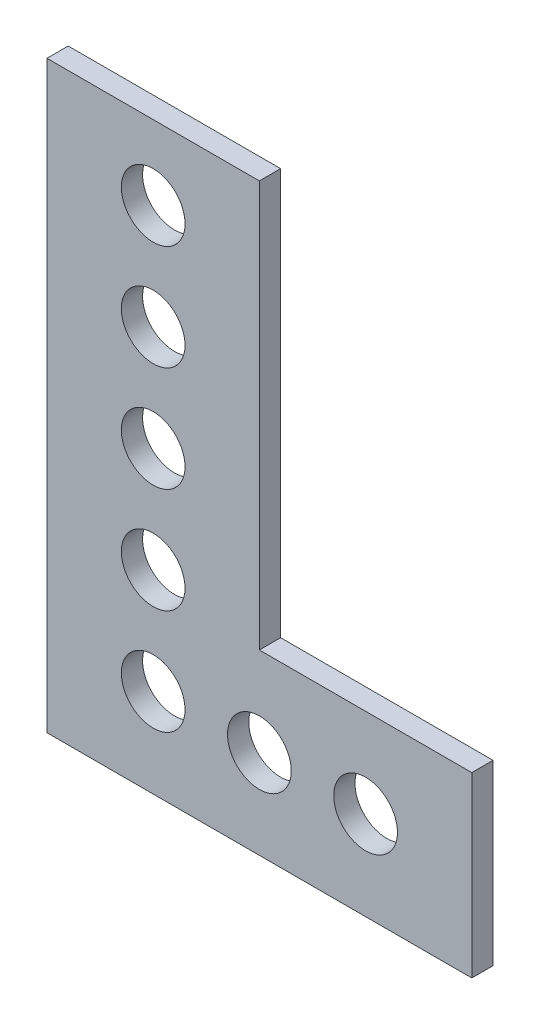
ISO-10303-21;
HEADER;
FILE_DESCRIPTION(('STEP AP214'),'2;1');
FILE_NAME('part.step','',(''),(''),'','','');
FILE_SCHEMA(('AUTOMOTIVE_DESIGN { 1 0 10303 214 1 1 1 1 }'));
ENDSEC;
DATA;
#1=APPLICATION_CONTEXT('core data for automotive mechanical design processes');
#2=APPLICATION_PROTOCOL_DEFINITION('international standard','automotive_design',2000,#1);
#3=PRODUCT_CONTEXT('',#1,'mechanical');
#4=PRODUCT('Part','Part','',(#3));
#5=PRODUCT_RELATED_PRODUCT_CATEGORY('part','',(#4));
#6=PRODUCT_DEFINITION_FORMATION('','',#4);
#7=PRODUCT_DEFINITION_CONTEXT('part definition',#1,'design');
#8=PRODUCT_DEFINITION('design','',#6,#7);
#9=PRODUCT_DEFINITION_SHAPE('','',#8);
#10=(LENGTH_UNIT() NAMED_UNIT(*) SI_UNIT(.MILLI.,.METRE.));
#11=(NAMED_UNIT(*) PLANE_ANGLE_UNIT() SI_UNIT($,.RADIAN.));
#12=(NAMED_UNIT(*) SI_UNIT($,.STERADIAN.) SOLID_ANGLE_UNIT());
#13=UNCERTAINTY_MEASURE_WITH_UNIT(LENGTH_MEASURE(1.E-05),#10,'distance_accuracy_value','');
#14=(GEOMETRIC_REPRESENTATION_CONTEXT(3) GLOBAL_UNCERTAINTY_ASSIGNED_CONTEXT((#13)) GLOBAL_UNIT_ASSIGNED_CONTEXT((#10,
#11,#12)) REPRESENTATION_CONTEXT('',''));
#15=CARTESIAN_POINT('',(0.,0.,0.));
#16=DIRECTION('',(0.,0.,1.));
#17=DIRECTION('',(1.,0.,0.));
#18=AXIS2_PLACEMENT_3D('',#15,#16,#17);
#19=CARTESIAN_POINT('',(0.,0.,2.));
#20=DIRECTION('',(0.,0.,1.));
#21=DIRECTION('',(1.,0.,0.));
#22=AXIS2_PLACEMENT_3D('',#19,#20,#21);
#23=PLANE('',#22);
#24=CARTESIAN_POINT('',(-10.0000000000001,8.3749999999999,2.));
#25=DIRECTION('',(0.,0.,1.));
#26=DIRECTION('',(1.,0.,0.));
#27=AXIS2_PLACEMENT_3D('',#24,#25,#26);
#28=CIRCLE('',#27,3.00000000000056);
#29=CARTESIAN_POINT('',(-6.99999999999954,8.3749999999999,2.));
#30=VERTEX_POINT('',#29);
#31=EDGE_CURVE('E201',#30,#30,#28,.T.);
#32=ORIENTED_EDGE('',*,*,#31,.F.);
#33=EDGE_LOOP('',(#32));
#34=FACE_BOUND('',#33,.T.);
#35=CARTESIAN_POINT('',(-9.99999999999997,28.1875,2.));
#36=DIRECTION('',(0.,0.,1.));
#37=DIRECTION('',(1.,0.,0.));
#38=AXIS2_PLACEMENT_3D('',#35,#36,#37);
#39=CIRCLE('',#38,3.);
#40=CARTESIAN_POINT('',(-6.99999999999997,28.1875,2.));
#41=VERTEX_POINT('',#40);
#42=EDGE_CURVE('E213',#41,#41,#39,.T.);
#43=ORIENTED_EDGE('',*,*,#42,.F.);
#44=EDGE_LOOP('',(#43));
#45=FACE_BOUND('',#44,.T.);
#46=CARTESIAN_POINT('',(9.99999999999982,8.375,2.));
#47=DIRECTION('',(0.,0.,1.));
#48=DIRECTION('',(1.,0.,0.));
#49=AXIS2_PLACEMENT_3D('',#46,#47,#48);
#50=CIRCLE('',#49,3.);
#51=CARTESIAN_POINT('',(12.9999999999998,8.375,2.));
#52=VERTEX_POINT('',#51);
#53=EDGE_CURVE('E225',#52,#52,#50,.T.);
#54=ORIENTED_EDGE('',*,*,#53,.F.);
#55=EDGE_LOOP('',(#54));
#56=FACE_BOUND('',#55,.T.);
#57=DIRECTION('',(-1.,0.,0.));
#58=VECTOR('',#57,1.);
#59=CARTESIAN_POINT('',(-1.75207071073657E-13,55.,2.));
#60=LINE('',#59,#58);
#61=CARTESIAN_POINT('',(-1.75207071073657E-13,55.,2.));
#62=VERTEX_POINT('',#61);
#63=CARTESIAN_POINT('',(-20.0000000000002,55.,2.));
#64=VERTEX_POINT('',#63);
#65=EDGE_CURVE('E129',#62,#64,#60,.T.);
#66=ORIENTED_EDGE('',*,*,#65,.T.);
#67=DIRECTION('',(0.,-1.,0.));
#68=VECTOR('',#67,1.);
#69=CARTESIAN_POINT('',(-20.0000000000002,55.,2.));
#70=LINE('',#69,#68);
#71=CARTESIAN_POINT('',(-20.,-2.09488880330588E-13,2.));
#72=VERTEX_POINT('',#71);
#73=EDGE_CURVE('E87',#64,#72,#70,.T.);
#74=ORIENTED_EDGE('',*,*,#73,.T.);
#75=DIRECTION('',(1.,0.,0.));
#76=VECTOR('',#75,1.);
#77=CARTESIAN_POINT('',(-20.,-2.09488880330588E-13,2.));
#78=LINE('',#77,#76);
#79=CARTESIAN_POINT('',(20.,2.09488880330588E-13,2.));
#80=VERTEX_POINT('',#79);
#81=EDGE_CURVE('E100',#72,#80,#78,.T.);
#82=ORIENTED_EDGE('',*,*,#81,.T.);
#83=DIRECTION('',(0.,1.,0.));
#84=VECTOR('',#83,1.);
#85=CARTESIAN_POINT('',(20.,2.09488880330588E-13,2.));
#86=LINE('',#85,#84);
#87=CARTESIAN_POINT('',(19.9999999999998,16.7500000000002,2.));
#88=VERTEX_POINT('',#87);
#89=EDGE_CURVE('E94',#80,#88,#86,.T.);
#90=ORIENTED_EDGE('',*,*,#89,.T.);
#91=DIRECTION('',(-1.,0.,0.));
#92=VECTOR('',#91,1.);
#93=CARTESIAN_POINT('',(19.9999999999998,16.7500000000002,2.));
#94=LINE('',#93,#92);
#95=CARTESIAN_POINT('',(-1.75446937276867E-13,16.75,2.));
#96=VERTEX_POINT('',#95);
#97=EDGE_CURVE('E98',#88,#96,#94,.T.);
#98=ORIENTED_EDGE('',*,*,#97,.T.);
#99=DIRECTION('',(0.,1.,0.));
#100=VECTOR('',#99,1.);
#101=CARTESIAN_POINT('',(-1.75446937276867E-13,16.75,2.));
#102=LINE('',#101,#100);
#103=EDGE_CURVE('E50',#96,#62,#102,.T.);
#104=ORIENTED_EDGE('',*,*,#103,.T.);
#105=EDGE_LOOP('',(#66,#74,#82,#90,#98,#104));
#106=FACE_BOUND('',#105,.T.);
#107=CARTESIAN_POINT('',(-10.0000000000002,48.,2.));
#108=DIRECTION('',(0.,0.,1.));
#109=DIRECTION('',(1.,0.,0.));
#110=AXIS2_PLACEMENT_3D('',#107,#108,#109);
#111=CIRCLE('',#110,3.00000000000001);
#112=CARTESIAN_POINT('',(-7.00000000000017,48.,2.));
#113=VERTEX_POINT('',#112);
#114=EDGE_CURVE('E122',#113,#113,#111,.T.);
#115=ORIENTED_EDGE('',*,*,#114,.F.);
#116=EDGE_LOOP('',(#115));
#117=FACE_BOUND('',#116,.T.);
#118=CARTESIAN_POINT('',(-10.0000000000001,38.09375,2.));
#119=DIRECTION('',(0.,0.,1.));
#120=DIRECTION('',(1.,0.,0.));
#121=AXIS2_PLACEMENT_3D('',#118,#119,#120);
#122=CIRCLE('',#121,3.);
#123=CARTESIAN_POINT('',(-7.00000000000007,38.09375,2.));
#124=VERTEX_POINT('',#123);
#125=EDGE_CURVE('E219',#124,#124,#122,.T.);
#126=ORIENTED_EDGE('',*,*,#125,.F.);
#127=EDGE_LOOP('',(#126));
#128=FACE_BOUND('',#127,.T.);
#129=CARTESIAN_POINT('',(-9.99999999999987,18.28125,2.));
#130=DIRECTION('',(0.,0.,1.));
#131=DIRECTION('',(1.,0.,0.));
#132=AXIS2_PLACEMENT_3D('',#129,#130,#131);
#133=CIRCLE('',#132,3.);
#134=CARTESIAN_POINT('',(-6.99999999999987,18.28125,2.));
#135=VERTEX_POINT('',#134);
#136=EDGE_CURVE('E207',#135,#135,#133,.T.);
#137=ORIENTED_EDGE('',*,*,#136,.F.);
#138=EDGE_LOOP('',(#137));
#139=FACE_BOUND('',#138,.T.);
#140=CARTESIAN_POINT('',(0.,8.3749999999999,2.));
#141=DIRECTION('',(0.,0.,1.));
#142=DIRECTION('',(1.,0.,0.));
#143=AXIS2_PLACEMENT_3D('',#140,#141,#142);
#144=CIRCLE('',#143,3.);
#145=CARTESIAN_POINT('',(2.99999999999996,8.3749999999999,2.));
#146=VERTEX_POINT('',#145);
#147=EDGE_CURVE('E192',#146,#146,#144,.T.);
#148=ORIENTED_EDGE('',*,*,#147,.F.);
#149=EDGE_LOOP('',(#148));
#150=FACE_BOUND('',#149,.T.);
#151=ADVANCED_FACE('F33',(#34,#45,#56,#106,#117,#128,#139,#150),#23,.T.);
#152=CARTESIAN_POINT('',(0.,0.,0.));
#153=DIRECTION('',(0.,0.,1.));
#154=DIRECTION('',(1.,0.,0.));
#155=AXIS2_PLACEMENT_3D('',#152,#153,#154);
#156=PLANE('',#155);
#157=DIRECTION('',(-1.,0.,0.));
#158=VECTOR('',#157,1.);
#159=CARTESIAN_POINT('',(-1.75207071073657E-13,55.,0.));
#160=LINE('',#159,#158);
#161=CARTESIAN_POINT('',(-1.75207071073657E-13,55.,0.));
#162=VERTEX_POINT('',#161);
#163=CARTESIAN_POINT('',(-20.0000000000002,55.,0.));
#164=VERTEX_POINT('',#163);
#165=EDGE_CURVE('E118',#162,#164,#160,.T.);
#166=ORIENTED_EDGE('',*,*,#165,.F.);
#167=DIRECTION('',(0.,1.,0.));
#168=VECTOR('',#167,1.);
#169=CARTESIAN_POINT('',(-1.75446937276867E-13,16.75,0.));
#170=LINE('',#169,#168);
#171=CARTESIAN_POINT('',(-1.75446937276867E-13,16.75,0.));
#172=VERTEX_POINT('',#171);
#173=EDGE_CURVE('E79',#172,#162,#170,.T.);
#174=ORIENTED_EDGE('',*,*,#173,.F.);
#175=DIRECTION('',(-1.,0.,0.));
#176=VECTOR('',#175,1.);
#177=CARTESIAN_POINT('',(19.9999999999998,16.7500000000002,0.));
#178=LINE('',#177,#176);
#179=CARTESIAN_POINT('',(19.9999999999998,16.7500000000002,0.));
#180=VERTEX_POINT('',#179);
#181=EDGE_CURVE('E73',#180,#172,#178,.T.);
#182=ORIENTED_EDGE('',*,*,#181,.F.);
#183=DIRECTION('',(0.,1.,0.));
#184=VECTOR('',#183,1.);
#185=CARTESIAN_POINT('',(20.,2.09488880330588E-13,0.));
#186=LINE('',#185,#184);
#187=CARTESIAN_POINT('',(20.,2.09488880330588E-13,0.));
#188=VERTEX_POINT('',#187);
#189=EDGE_CURVE('E108',#188,#180,#186,.T.);
#190=ORIENTED_EDGE('',*,*,#189,.F.);
#191=DIRECTION('',(1.,0.,0.));
#192=VECTOR('',#191,1.);
#193=CARTESIAN_POINT('',(-20.,-2.09488880330588E-13,0.));
#194=LINE('',#193,#192);
#195=CARTESIAN_POINT('',(-20.,-2.09488880330588E-13,0.));
#196=VERTEX_POINT('',#195);
#197=EDGE_CURVE('E124',#196,#188,#194,.T.);
#198=ORIENTED_EDGE('',*,*,#197,.F.);
#199=DIRECTION('',(0.,-1.,0.));
#200=VECTOR('',#199,1.);
#201=CARTESIAN_POINT('',(-20.0000000000002,55.,0.));
#202=LINE('',#201,#200);
#203=EDGE_CURVE('E121',#164,#196,#202,.T.);
#204=ORIENTED_EDGE('',*,*,#203,.F.);
#205=EDGE_LOOP('',(#166,#174,#182,#190,#198,#204));
#206=FACE_BOUND('',#205,.T.);
#207=CARTESIAN_POINT('',(-10.0000000000002,48.,0.));
#208=DIRECTION('',(0.,0.,1.));
#209=DIRECTION('',(1.,0.,0.));
#210=AXIS2_PLACEMENT_3D('',#207,#208,#209);
#211=CIRCLE('',#210,3.00000000000001);
#212=CARTESIAN_POINT('',(-7.00000000000017,48.,0.));
#213=VERTEX_POINT('',#212);
#214=EDGE_CURVE('E228',#213,#213,#211,.T.);
#215=ORIENTED_EDGE('',*,*,#214,.T.);
#216=EDGE_LOOP('',(#215));
#217=FACE_BOUND('',#216,.T.);
#218=CARTESIAN_POINT('',(9.99999999999982,8.375,0.));
#219=DIRECTION('',(0.,0.,1.));
#220=DIRECTION('',(1.,0.,0.));
#221=AXIS2_PLACEMENT_3D('',#218,#219,#220);
#222=CIRCLE('',#221,3.);
#223=CARTESIAN_POINT('',(12.9999999999998,8.375,0.));
#224=VERTEX_POINT('',#223);
#225=EDGE_CURVE('E222',#224,#224,#222,.T.);
#226=ORIENTED_EDGE('',*,*,#225,.T.);
#227=EDGE_LOOP('',(#226));
#228=FACE_BOUND('',#227,.T.);
#229=CARTESIAN_POINT('',(-10.0000000000001,38.09375,0.));
#230=DIRECTION('',(0.,0.,1.));
#231=DIRECTION('',(1.,0.,0.));
#232=AXIS2_PLACEMENT_3D('',#229,#230,#231);
#233=CIRCLE('',#232,3.);
#234=CARTESIAN_POINT('',(-7.00000000000007,38.09375,0.));
#235=VERTEX_POINT('',#234);
#236=EDGE_CURVE('E216',#235,#235,#233,.T.);
#237=ORIENTED_EDGE('',*,*,#236,.T.);
#238=EDGE_LOOP('',(#237));
#239=FACE_BOUND('',#238,.T.);
#240=CARTESIAN_POINT('',(-9.99999999999997,28.1875,0.));
#241=DIRECTION('',(0.,0.,1.));
#242=DIRECTION('',(1.,0.,0.));
#243=AXIS2_PLACEMENT_3D('',#240,#241,#242);
#244=CIRCLE('',#243,3.);
#245=CARTESIAN_POINT('',(-6.99999999999997,28.1875,0.));
#246=VERTEX_POINT('',#245);
#247=EDGE_CURVE('E210',#246,#246,#244,.T.);
#248=ORIENTED_EDGE('',*,*,#247,.T.);
#249=EDGE_LOOP('',(#248));
#250=FACE_BOUND('',#249,.T.);
#251=CARTESIAN_POINT('',(-9.99999999999987,18.28125,0.));
#252=DIRECTION('',(0.,0.,1.));
#253=DIRECTION('',(1.,0.,0.));
#254=AXIS2_PLACEMENT_3D('',#251,#252,#253);
#255=CIRCLE('',#254,3.);
#256=CARTESIAN_POINT('',(-6.99999999999987,18.28125,0.));
#257=VERTEX_POINT('',#256);
#258=EDGE_CURVE('E204',#257,#257,#255,.T.);
#259=ORIENTED_EDGE('',*,*,#258,.T.);
#260=EDGE_LOOP('',(#259));
#261=FACE_BOUND('',#260,.T.);
#262=CARTESIAN_POINT('',(-10.0000000000001,8.3749999999999,0.));
#263=DIRECTION('',(0.,0.,1.));
#264=DIRECTION('',(1.,0.,0.));
#265=AXIS2_PLACEMENT_3D('',#262,#263,#264);
#266=CIRCLE('',#265,3.00000000000056);
#267=CARTESIAN_POINT('',(-6.99999999999954,8.3749999999999,0.));
#268=VERTEX_POINT('',#267);
#269=EDGE_CURVE('E198',#268,#268,#266,.T.);
#270=ORIENTED_EDGE('',*,*,#269,.T.);
#271=EDGE_LOOP('',(#270));
#272=FACE_BOUND('',#271,.T.);
#273=CARTESIAN_POINT('',(0.,8.3749999999999,0.));
#274=DIRECTION('',(0.,0.,1.));
#275=DIRECTION('',(1.,0.,0.));
#276=AXIS2_PLACEMENT_3D('',#273,#274,#275);
#277=CIRCLE('',#276,3.);
#278=CARTESIAN_POINT('',(2.99999999999996,8.3749999999999,0.));
#279=VERTEX_POINT('',#278);
#280=EDGE_CURVE('E195',#279,#279,#277,.T.);
#281=ORIENTED_EDGE('',*,*,#280,.T.);
#282=EDGE_LOOP('',(#281));
#283=FACE_BOUND('',#282,.T.);
#284=ADVANCED_FACE('F138',(#206,#217,#228,#239,#250,#261,#272,#283),#156,.F.);
#285=CARTESIAN_POINT('',(-1.75207071073657E-13,55.,2.));
#286=DIRECTION('',(0.,-1.,0.));
#287=DIRECTION('',(0.,0.,-1.));
#288=AXIS2_PLACEMENT_3D('',#285,#286,#287);
#289=PLANE('',#288);
#290=ORIENTED_EDGE('',*,*,#165,.T.);
#291=DIRECTION('',(0.,0.,-1.));
#292=VECTOR('',#291,1.);
#293=CARTESIAN_POINT('',(-20.0000000000002,55.,2.));
#294=LINE('',#293,#292);
#295=EDGE_CURVE('E11',#64,#164,#294,.T.);
#296=ORIENTED_EDGE('',*,*,#295,.F.);
#297=ORIENTED_EDGE('',*,*,#65,.F.);
#298=DIRECTION('',(0.,0.,-1.));
#299=VECTOR('',#298,1.);
#300=CARTESIAN_POINT('',(-1.75207071073657E-13,55.,2.));
#301=LINE('',#300,#299);
#302=EDGE_CURVE('E114',#62,#162,#301,.T.);
#303=ORIENTED_EDGE('',*,*,#302,.T.);
#304=EDGE_LOOP('',(#290,#296,#297,#303));
#305=FACE_BOUND('',#304,.T.);
#306=ADVANCED_FACE('F35',(#305),#289,.F.);
#307=CARTESIAN_POINT('',(-20.0000000000002,55.,2.));
#308=DIRECTION('',(1.,0.,0.));
#309=DIRECTION('',(0.,1.,0.));
#310=AXIS2_PLACEMENT_3D('',#307,#308,#309);
#311=PLANE('',#310);
#312=ORIENTED_EDGE('',*,*,#203,.T.);
#313=DIRECTION('',(0.,0.,-1.));
#314=VECTOR('',#313,1.);
#315=CARTESIAN_POINT('',(-20.,-2.09488880330588E-13,2.));
#316=LINE('',#315,#314);
#317=EDGE_CURVE('E42',#72,#196,#316,.T.);
#318=ORIENTED_EDGE('',*,*,#317,.F.);
#319=ORIENTED_EDGE('',*,*,#73,.F.);
#320=ORIENTED_EDGE('',*,*,#295,.T.);
#321=EDGE_LOOP('',(#312,#318,#319,#320));
#322=FACE_BOUND('',#321,.T.);
#323=ADVANCED_FACE('F313',(#322),#311,.F.);
#324=CARTESIAN_POINT('',(-20.,-2.09488880330588E-13,2.));
#325=DIRECTION('',(0.,1.,0.));
#326=DIRECTION('',(-1.,0.,0.));
#327=AXIS2_PLACEMENT_3D('',#324,#325,#326);
#328=PLANE('',#327);
#329=ORIENTED_EDGE('',*,*,#197,.T.);
#330=DIRECTION('',(0.,0.,-1.));
#331=VECTOR('',#330,1.);
#332=CARTESIAN_POINT('',(20.,2.09488880330588E-13,2.));
#333=LINE('',#332,#331);
#334=EDGE_CURVE('E109',#80,#188,#333,.T.);
#335=ORIENTED_EDGE('',*,*,#334,.F.);
#336=ORIENTED_EDGE('',*,*,#81,.F.);
#337=ORIENTED_EDGE('',*,*,#317,.T.);
#338=EDGE_LOOP('',(#329,#335,#336,#337));
#339=FACE_BOUND('',#338,.T.);
#340=ADVANCED_FACE('F135',(#339),#328,.F.);
#341=CARTESIAN_POINT('',(20.,2.09488880330588E-13,2.));
#342=DIRECTION('',(-1.,0.,0.));
#343=DIRECTION('',(0.,-1.,0.));
#344=AXIS2_PLACEMENT_3D('',#341,#342,#343);
#345=PLANE('',#344);
#346=ORIENTED_EDGE('',*,*,#189,.T.);
#347=DIRECTION('',(0.,0.,-1.));
#348=VECTOR('',#347,1.);
#349=CARTESIAN_POINT('',(19.9999999999998,16.7500000000002,2.));
#350=LINE('',#349,#348);
#351=EDGE_CURVE('E105',#88,#180,#350,.T.);
#352=ORIENTED_EDGE('',*,*,#351,.F.);
#353=ORIENTED_EDGE('',*,*,#89,.F.);
#354=ORIENTED_EDGE('',*,*,#334,.T.);
#355=EDGE_LOOP('',(#346,#352,#353,#354));
#356=FACE_BOUND('',#355,.T.);
#357=ADVANCED_FACE('F106',(#356),#345,.F.);
#358=CARTESIAN_POINT('',(19.9999999999998,16.7500000000002,2.));
#359=DIRECTION('',(0.,-1.,0.));
#360=DIRECTION('',(1.,0.,0.));
#361=AXIS2_PLACEMENT_3D('',#358,#359,#360);
#362=PLANE('',#361);
#363=ORIENTED_EDGE('',*,*,#181,.T.);
#364=DIRECTION('',(0.,0.,-1.));
#365=VECTOR('',#364,1.);
#366=CARTESIAN_POINT('',(-1.75446937276867E-13,16.75,2.));
#367=LINE('',#366,#365);
#368=EDGE_CURVE('E110',#96,#172,#367,.T.);
#369=ORIENTED_EDGE('',*,*,#368,.F.);
#370=ORIENTED_EDGE('',*,*,#97,.F.);
#371=ORIENTED_EDGE('',*,*,#351,.T.);
#372=EDGE_LOOP('',(#363,#369,#370,#371));
#373=FACE_BOUND('',#372,.T.);
#374=ADVANCED_FACE('F112',(#373),#362,.F.);
#375=CARTESIAN_POINT('',(-1.75446937276867E-13,16.75,2.));
#376=DIRECTION('',(-1.,0.,0.));
#377=DIRECTION('',(0.,-1.,0.));
#378=AXIS2_PLACEMENT_3D('',#375,#376,#377);
#379=PLANE('',#378);
#380=ORIENTED_EDGE('',*,*,#173,.T.);
#381=ORIENTED_EDGE('',*,*,#302,.F.);
#382=ORIENTED_EDGE('',*,*,#103,.F.);
#383=ORIENTED_EDGE('',*,*,#368,.T.);
#384=EDGE_LOOP('',(#380,#381,#382,#383));
#385=FACE_BOUND('',#384,.T.);
#386=ADVANCED_FACE('F143',(#385),#379,.F.);
#387=CARTESIAN_POINT('',(-10.0000000000002,48.,2.));
#388=DIRECTION('',(0.,0.,-1.));
#389=DIRECTION('',(-1.,0.,0.));
#390=AXIS2_PLACEMENT_3D('',#387,#388,#389);
#391=CYLINDRICAL_SURFACE('',#390,3.00000000000001);
#392=ORIENTED_EDGE('',*,*,#114,.T.);
#393=EDGE_LOOP('',(#392));
#394=FACE_BOUND('',#393,.T.);
#395=ORIENTED_EDGE('',*,*,#214,.F.);
#396=EDGE_LOOP('',(#395));
#397=FACE_BOUND('',#396,.T.);
#398=ADVANCED_FACE('F145',(#394,#397),#391,.F.);
#399=CARTESIAN_POINT('',(9.99999999999982,8.375,2.));
#400=DIRECTION('',(0.,0.,-1.));
#401=DIRECTION('',(-1.,0.,0.));
#402=AXIS2_PLACEMENT_3D('',#399,#400,#401);
#403=CYLINDRICAL_SURFACE('',#402,3.);
#404=ORIENTED_EDGE('',*,*,#53,.T.);
#405=EDGE_LOOP('',(#404));
#406=FACE_BOUND('',#405,.T.);
#407=ORIENTED_EDGE('',*,*,#225,.F.);
#408=EDGE_LOOP('',(#407));
#409=FACE_BOUND('',#408,.T.);
#410=ADVANCED_FACE('F151',(#406,#409),#403,.F.);
#411=CARTESIAN_POINT('',(-10.0000000000001,38.09375,2.));
#412=DIRECTION('',(0.,0.,-1.));
#413=DIRECTION('',(-1.,0.,0.));
#414=AXIS2_PLACEMENT_3D('',#411,#412,#413);
#415=CYLINDRICAL_SURFACE('',#414,3.);
#416=ORIENTED_EDGE('',*,*,#125,.T.);
#417=EDGE_LOOP('',(#416));
#418=FACE_BOUND('',#417,.T.);
#419=ORIENTED_EDGE('',*,*,#236,.F.);
#420=EDGE_LOOP('',(#419));
#421=FACE_BOUND('',#420,.T.);
#422=ADVANCED_FACE('F167',(#418,#421),#415,.F.);
#423=CARTESIAN_POINT('',(-9.99999999999997,28.1875,2.));
#424=DIRECTION('',(0.,0.,-1.));
#425=DIRECTION('',(-1.,0.,0.));
#426=AXIS2_PLACEMENT_3D('',#423,#424,#425);
#427=CYLINDRICAL_SURFACE('',#426,3.);
#428=ORIENTED_EDGE('',*,*,#42,.T.);
#429=EDGE_LOOP('',(#428));
#430=FACE_BOUND('',#429,.T.);
#431=ORIENTED_EDGE('',*,*,#247,.F.);
#432=EDGE_LOOP('',(#431));
#433=FACE_BOUND('',#432,.T.);
#434=ADVANCED_FACE('F171',(#430,#433),#427,.F.);
#435=CARTESIAN_POINT('',(-9.99999999999987,18.28125,2.));
#436=DIRECTION('',(0.,0.,-1.));
#437=DIRECTION('',(-1.,0.,0.));
#438=AXIS2_PLACEMENT_3D('',#435,#436,#437);
#439=CYLINDRICAL_SURFACE('',#438,3.);
#440=ORIENTED_EDGE('',*,*,#136,.T.);
#441=EDGE_LOOP('',(#440));
#442=FACE_BOUND('',#441,.T.);
#443=ORIENTED_EDGE('',*,*,#258,.F.);
#444=EDGE_LOOP('',(#443));
#445=FACE_BOUND('',#444,.T.);
#446=ADVANCED_FACE('F175',(#442,#445),#439,.F.);
#447=CARTESIAN_POINT('',(-10.0000000000001,8.3749999999999,2.));
#448=DIRECTION('',(0.,0.,-1.));
#449=DIRECTION('',(-1.,0.,0.));
#450=AXIS2_PLACEMENT_3D('',#447,#448,#449);
#451=CYLINDRICAL_SURFACE('',#450,3.00000000000056);
#452=ORIENTED_EDGE('',*,*,#31,.T.);
#453=EDGE_LOOP('',(#452));
#454=FACE_BOUND('',#453,.T.);
#455=ORIENTED_EDGE('',*,*,#269,.F.);
#456=EDGE_LOOP('',(#455));
#457=FACE_BOUND('',#456,.T.);
#458=ADVANCED_FACE('F179',(#454,#457),#451,.F.);
#459=CARTESIAN_POINT('',(0.,8.3749999999999,2.));
#460=DIRECTION('',(0.,0.,-1.));
#461=DIRECTION('',(-1.,0.,0.));
#462=AXIS2_PLACEMENT_3D('',#459,#460,#461);
#463=CYLINDRICAL_SURFACE('',#462,3.);
#464=ORIENTED_EDGE('',*,*,#147,.T.);
#465=EDGE_LOOP('',(#464));
#466=FACE_BOUND('',#465,.T.);
#467=ORIENTED_EDGE('',*,*,#280,.F.);
#468=EDGE_LOOP('',(#467));
#469=FACE_BOUND('',#468,.T.);
#470=ADVANCED_FACE('F183',(#466,#469),#463,.F.);
#471=CLOSED_SHELL('',(#151,#284,#306,#323,#340,#357,#374,#386,#398,#410,#422,#434,#446,#458,#470));
#472=MANIFOLD_SOLID_BREP('B2',#471);
#473=ADVANCED_BREP_SHAPE_REPRESENTATION('',(#18,#472),#14);
#474=SHAPE_DEFINITION_REPRESENTATION(#9,#473);
ENDSEC;
END-ISO-10303-21;
